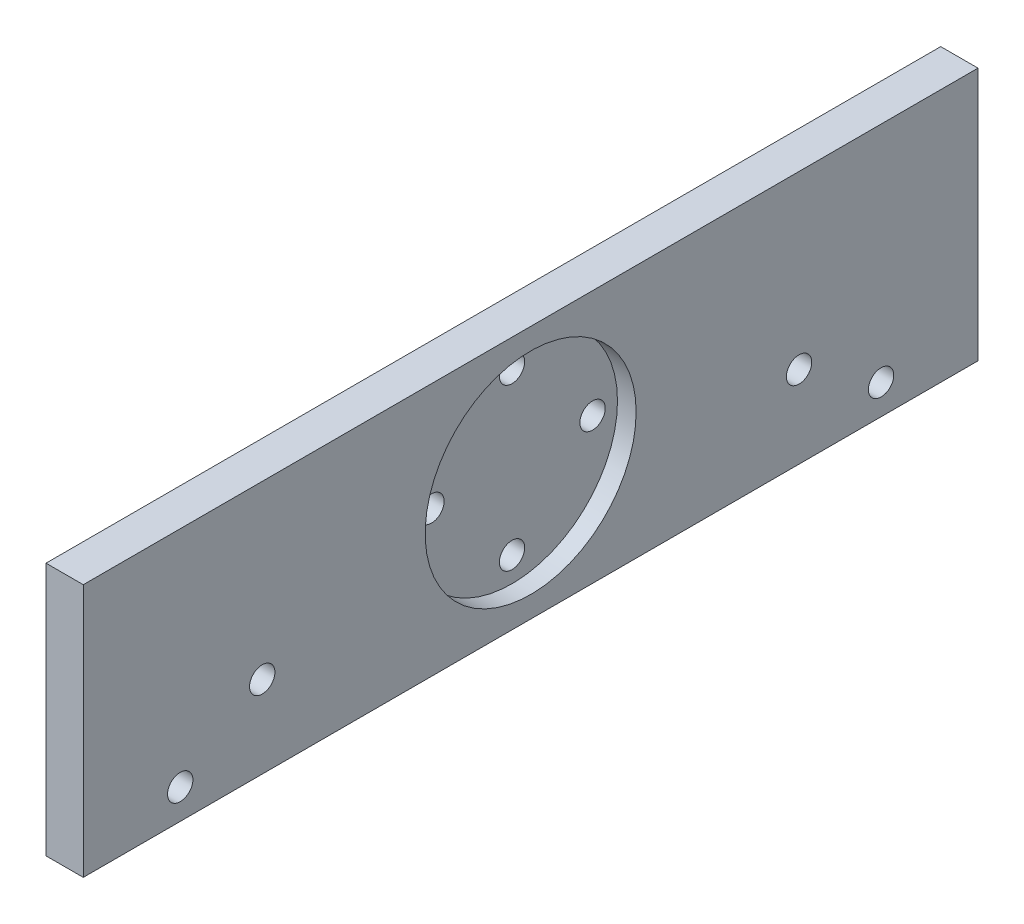
ISO-10303-21;
HEADER;
FILE_DESCRIPTION(('STEP AP214'),'2;1');
FILE_NAME('part.step','',(''),(''),'','','');
FILE_SCHEMA(('AUTOMOTIVE_DESIGN { 1 0 10303 214 1 1 1 1 }'));
ENDSEC;
DATA;
#1=APPLICATION_CONTEXT('core data for automotive mechanical design processes');
#2=APPLICATION_PROTOCOL_DEFINITION('international standard','automotive_design',2000,#1);
#3=PRODUCT_CONTEXT('',#1,'mechanical');
#4=PRODUCT('Part','Part','',(#3));
#5=PRODUCT_RELATED_PRODUCT_CATEGORY('part','',(#4));
#6=PRODUCT_DEFINITION_FORMATION('','',#4);
#7=PRODUCT_DEFINITION_CONTEXT('part definition',#1,'design');
#8=PRODUCT_DEFINITION('design','',#6,#7);
#9=PRODUCT_DEFINITION_SHAPE('','',#8);
#10=(LENGTH_UNIT() NAMED_UNIT(*) SI_UNIT(.MILLI.,.METRE.));
#11=(NAMED_UNIT(*) PLANE_ANGLE_UNIT() SI_UNIT($,.RADIAN.));
#12=(NAMED_UNIT(*) SI_UNIT($,.STERADIAN.) SOLID_ANGLE_UNIT());
#13=UNCERTAINTY_MEASURE_WITH_UNIT(LENGTH_MEASURE(1.E-05),#10,'distance_accuracy_value','');
#14=(GEOMETRIC_REPRESENTATION_CONTEXT(3) GLOBAL_UNCERTAINTY_ASSIGNED_CONTEXT((#13)) GLOBAL_UNIT_ASSIGNED_CONTEXT((#10,
#11,#12)) REPRESENTATION_CONTEXT('',''));
#15=CARTESIAN_POINT('',(0.,0.,0.));
#16=DIRECTION('',(0.,0.,1.));
#17=DIRECTION('',(1.,0.,0.));
#18=AXIS2_PLACEMENT_3D('',#15,#16,#17);
#19=CARTESIAN_POINT('',(5.,0.,120.));
#20=DIRECTION('',(0.,0.,1.));
#21=DIRECTION('',(1.,0.,0.));
#22=AXIS2_PLACEMENT_3D('',#19,#20,#21);
#23=PLANE('',#22);
#24=DIRECTION('',(0.,1.,0.));
#25=VECTOR('',#24,1.);
#26=CARTESIAN_POINT('',(0.,0.,120.));
#27=LINE('',#26,#25);
#28=CARTESIAN_POINT('',(0.,0.,120.));
#29=VERTEX_POINT('',#28);
#30=CARTESIAN_POINT('',(0.,34.,120.));
#31=VERTEX_POINT('',#30);
#32=EDGE_CURVE('E104',#29,#31,#27,.T.);
#33=ORIENTED_EDGE('',*,*,#32,.F.);
#34=DIRECTION('',(-1.,0.,0.));
#35=VECTOR('',#34,1.);
#36=CARTESIAN_POINT('',(5.,0.,120.));
#37=LINE('',#36,#35);
#38=CARTESIAN_POINT('',(5.,0.,120.));
#39=VERTEX_POINT('',#38);
#40=EDGE_CURVE('E11',#39,#29,#37,.T.);
#41=ORIENTED_EDGE('',*,*,#40,.F.);
#42=DIRECTION('',(0.,1.,0.));
#43=VECTOR('',#42,1.);
#44=CARTESIAN_POINT('',(5.,0.,120.));
#45=LINE('',#44,#43);
#46=CARTESIAN_POINT('',(5.,34.,120.));
#47=VERTEX_POINT('',#46);
#48=EDGE_CURVE('E97',#39,#47,#45,.T.);
#49=ORIENTED_EDGE('',*,*,#48,.T.);
#50=DIRECTION('',(-1.,0.,0.));
#51=VECTOR('',#50,1.);
#52=CARTESIAN_POINT('',(5.,34.,120.));
#53=LINE('',#52,#51);
#54=EDGE_CURVE('E77',#47,#31,#53,.T.);
#55=ORIENTED_EDGE('',*,*,#54,.T.);
#56=EDGE_LOOP('',(#33,#41,#49,#55));
#57=FACE_BOUND('',#56,.T.);
#58=ADVANCED_FACE('F37',(#57),#23,.T.);
#59=CARTESIAN_POINT('',(5.,0.,0.));
#60=DIRECTION('',(0.,-1.,0.));
#61=DIRECTION('',(0.,0.,-1.));
#62=AXIS2_PLACEMENT_3D('',#59,#60,#61);
#63=PLANE('',#62);
#64=DIRECTION('',(0.,0.,1.));
#65=VECTOR('',#64,1.);
#66=CARTESIAN_POINT('',(0.,0.,0.));
#67=LINE('',#66,#65);
#68=CARTESIAN_POINT('',(0.,0.,0.));
#69=VERTEX_POINT('',#68);
#70=EDGE_CURVE('E90',#69,#29,#67,.T.);
#71=ORIENTED_EDGE('',*,*,#70,.F.);
#72=DIRECTION('',(-1.,0.,0.));
#73=VECTOR('',#72,1.);
#74=CARTESIAN_POINT('',(5.,0.,0.));
#75=LINE('',#74,#73);
#76=CARTESIAN_POINT('',(5.,0.,0.));
#77=VERTEX_POINT('',#76);
#78=EDGE_CURVE('E46',#77,#69,#75,.T.);
#79=ORIENTED_EDGE('',*,*,#78,.F.);
#80=DIRECTION('',(0.,0.,1.));
#81=VECTOR('',#80,1.);
#82=CARTESIAN_POINT('',(5.,0.,0.));
#83=LINE('',#82,#81);
#84=EDGE_CURVE('E88',#77,#39,#83,.T.);
#85=ORIENTED_EDGE('',*,*,#84,.T.);
#86=ORIENTED_EDGE('',*,*,#40,.T.);
#87=EDGE_LOOP('',(#71,#79,#85,#86));
#88=FACE_BOUND('',#87,.T.);
#89=ADVANCED_FACE('F86',(#88),#63,.T.);
#90=CARTESIAN_POINT('',(5.,0.,0.));
#91=DIRECTION('',(0.,0.,1.));
#92=DIRECTION('',(0.,-1.,0.));
#93=AXIS2_PLACEMENT_3D('',#90,#91,#92);
#94=PLANE('',#93);
#95=DIRECTION('',(0.,1.,0.));
#96=VECTOR('',#95,1.);
#97=CARTESIAN_POINT('',(0.,0.,0.));
#98=LINE('',#97,#96);
#99=CARTESIAN_POINT('',(0.,34.,0.));
#100=VERTEX_POINT('',#99);
#101=EDGE_CURVE('E70',#69,#100,#98,.T.);
#102=ORIENTED_EDGE('',*,*,#101,.T.);
#103=DIRECTION('',(-1.,0.,0.));
#104=VECTOR('',#103,1.);
#105=CARTESIAN_POINT('',(5.,34.,0.));
#106=LINE('',#105,#104);
#107=CARTESIAN_POINT('',(5.,34.,0.));
#108=VERTEX_POINT('',#107);
#109=EDGE_CURVE('E91',#108,#100,#106,.T.);
#110=ORIENTED_EDGE('',*,*,#109,.F.);
#111=DIRECTION('',(0.,1.,0.));
#112=VECTOR('',#111,1.);
#113=CARTESIAN_POINT('',(5.,0.,0.));
#114=LINE('',#113,#112);
#115=EDGE_CURVE('E93',#77,#108,#114,.T.);
#116=ORIENTED_EDGE('',*,*,#115,.F.);
#117=ORIENTED_EDGE('',*,*,#78,.T.);
#118=EDGE_LOOP('',(#102,#110,#116,#117));
#119=FACE_BOUND('',#118,.T.);
#120=ADVANCED_FACE('F94',(#119),#94,.F.);
#121=CARTESIAN_POINT('',(5.,34.,0.));
#122=DIRECTION('',(0.,-1.,0.));
#123=DIRECTION('',(0.,0.,-1.));
#124=AXIS2_PLACEMENT_3D('',#121,#122,#123);
#125=PLANE('',#124);
#126=DIRECTION('',(0.,0.,1.));
#127=VECTOR('',#126,1.);
#128=CARTESIAN_POINT('',(0.,34.,0.));
#129=LINE('',#128,#127);
#130=EDGE_CURVE('E99',#100,#31,#129,.T.);
#131=ORIENTED_EDGE('',*,*,#130,.T.);
#132=ORIENTED_EDGE('',*,*,#54,.F.);
#133=DIRECTION('',(0.,0.,1.));
#134=VECTOR('',#133,1.);
#135=CARTESIAN_POINT('',(5.,34.,0.));
#136=LINE('',#135,#134);
#137=EDGE_CURVE('E55',#108,#47,#136,.T.);
#138=ORIENTED_EDGE('',*,*,#137,.F.);
#139=ORIENTED_EDGE('',*,*,#109,.T.);
#140=EDGE_LOOP('',(#131,#132,#138,#139));
#141=FACE_BOUND('',#140,.T.);
#142=ADVANCED_FACE('F147',(#141),#125,.F.);
#143=CARTESIAN_POINT('',(5.,0.,0.));
#144=DIRECTION('',(1.,0.,0.));
#145=DIRECTION('',(0.,0.,-1.));
#146=AXIS2_PLACEMENT_3D('',#143,#144,#145);
#147=PLANE('',#146);
#148=CARTESIAN_POINT('',(5.,11.,24.));
#149=DIRECTION('',(1.,0.,0.));
#150=DIRECTION('',(0.,0.,-1.));
#151=AXIS2_PLACEMENT_3D('',#148,#149,#150);
#152=CIRCLE('',#151,1.69999999999999);
#153=CARTESIAN_POINT('',(5.,11.,22.3));
#154=VERTEX_POINT('',#153);
#155=EDGE_CURVE('E293',#154,#154,#152,.T.);
#156=ORIENTED_EDGE('',*,*,#155,.F.);
#157=EDGE_LOOP('',(#156));
#158=FACE_BOUND('',#157,.T.);
#159=CARTESIAN_POINT('',(5.,4.00000000000003,13.));
#160=DIRECTION('',(1.,0.,0.));
#161=DIRECTION('',(0.,0.,-1.));
#162=AXIS2_PLACEMENT_3D('',#159,#160,#161);
#163=CIRCLE('',#162,1.69999999999999);
#164=CARTESIAN_POINT('',(5.,4.00000000000003,11.3));
#165=VERTEX_POINT('',#164);
#166=EDGE_CURVE('E303',#165,#165,#163,.T.);
#167=ORIENTED_EDGE('',*,*,#166,.F.);
#168=EDGE_LOOP('',(#167));
#169=FACE_BOUND('',#168,.T.);
#170=CARTESIAN_POINT('',(5.,11.,96.));
#171=DIRECTION('',(1.,0.,0.));
#172=DIRECTION('',(0.,0.,-1.));
#173=AXIS2_PLACEMENT_3D('',#170,#171,#172);
#174=CIRCLE('',#173,1.69999999999999);
#175=CARTESIAN_POINT('',(5.,11.,94.3));
#176=VERTEX_POINT('',#175);
#177=EDGE_CURVE('E309',#176,#176,#174,.T.);
#178=ORIENTED_EDGE('',*,*,#177,.F.);
#179=EDGE_LOOP('',(#178));
#180=FACE_BOUND('',#179,.T.);
#181=CARTESIAN_POINT('',(5.,4.00000000000001,107.));
#182=DIRECTION('',(1.,0.,0.));
#183=DIRECTION('',(0.,0.,-1.));
#184=AXIS2_PLACEMENT_3D('',#181,#182,#183);
#185=CIRCLE('',#184,1.69999999999999);
#186=CARTESIAN_POINT('',(5.,4.00000000000001,105.3));
#187=VERTEX_POINT('',#186);
#188=EDGE_CURVE('E314',#187,#187,#185,.T.);
#189=ORIENTED_EDGE('',*,*,#188,.F.);
#190=EDGE_LOOP('',(#189));
#191=FACE_BOUND('',#190,.T.);
#192=CARTESIAN_POINT('',(5.,17.,60.));
#193=DIRECTION('',(1.,0.,0.));
#194=DIRECTION('',(0.,0.,-1.));
#195=AXIS2_PLACEMENT_3D('',#192,#193,#194);
#196=CIRCLE('',#195,14.15);
#197=CARTESIAN_POINT('',(5.,17.,45.85));
#198=VERTEX_POINT('',#197);
#199=EDGE_CURVE('E138',#198,#198,#196,.T.);
#200=ORIENTED_EDGE('',*,*,#199,.F.);
#201=EDGE_LOOP('',(#200));
#202=FACE_BOUND('',#201,.T.);
#203=ORIENTED_EDGE('',*,*,#48,.F.);
#204=ORIENTED_EDGE('',*,*,#84,.F.);
#205=ORIENTED_EDGE('',*,*,#115,.T.);
#206=ORIENTED_EDGE('',*,*,#137,.T.);
#207=EDGE_LOOP('',(#203,#204,#205,#206));
#208=FACE_BOUND('',#207,.T.);
#209=ADVANCED_FACE('F96',(#158,#169,#180,#191,#202,#208),#147,.T.);
#210=CARTESIAN_POINT('',(0.,0.,0.));
#211=DIRECTION('',(1.,0.,0.));
#212=DIRECTION('',(0.,0.,-1.));
#213=AXIS2_PLACEMENT_3D('',#210,#211,#212);
#214=PLANE('',#213);
#215=CARTESIAN_POINT('',(0.,11.,24.));
#216=DIRECTION('',(-1.,0.,0.));
#217=DIRECTION('',(0.,0.,1.));
#218=AXIS2_PLACEMENT_3D('',#215,#216,#217);
#219=CIRCLE('',#218,1.69999999999999);
#220=CARTESIAN_POINT('',(0.,11.,25.7));
#221=VERTEX_POINT('',#220);
#222=EDGE_CURVE('E296',#221,#221,#219,.T.);
#223=ORIENTED_EDGE('',*,*,#222,.F.);
#224=EDGE_LOOP('',(#223));
#225=FACE_BOUND('',#224,.T.);
#226=CARTESIAN_POINT('',(0.,4.00000000000003,13.));
#227=DIRECTION('',(-1.,0.,0.));
#228=DIRECTION('',(0.,0.,1.));
#229=AXIS2_PLACEMENT_3D('',#226,#227,#228);
#230=CIRCLE('',#229,1.69999999999999);
#231=CARTESIAN_POINT('',(0.,4.00000000000003,14.7));
#232=VERTEX_POINT('',#231);
#233=EDGE_CURVE('E298',#232,#232,#230,.T.);
#234=ORIENTED_EDGE('',*,*,#233,.F.);
#235=EDGE_LOOP('',(#234));
#236=FACE_BOUND('',#235,.T.);
#237=CARTESIAN_POINT('',(0.,11.,96.));
#238=DIRECTION('',(-1.,0.,0.));
#239=DIRECTION('',(0.,0.,1.));
#240=AXIS2_PLACEMENT_3D('',#237,#238,#239);
#241=CIRCLE('',#240,1.69999999999999);
#242=CARTESIAN_POINT('',(0.,11.,97.7));
#243=VERTEX_POINT('',#242);
#244=EDGE_CURVE('E306',#243,#243,#241,.T.);
#245=ORIENTED_EDGE('',*,*,#244,.F.);
#246=EDGE_LOOP('',(#245));
#247=FACE_BOUND('',#246,.T.);
#248=CARTESIAN_POINT('',(0.,4.00000000000001,107.));
#249=DIRECTION('',(-1.,0.,0.));
#250=DIRECTION('',(0.,0.,1.));
#251=AXIS2_PLACEMENT_3D('',#248,#249,#250);
#252=CIRCLE('',#251,1.69999999999999);
#253=CARTESIAN_POINT('',(0.,4.00000000000001,108.7));
#254=VERTEX_POINT('',#253);
#255=EDGE_CURVE('E312',#254,#254,#252,.T.);
#256=ORIENTED_EDGE('',*,*,#255,.F.);
#257=EDGE_LOOP('',(#256));
#258=FACE_BOUND('',#257,.T.);
#259=CARTESIAN_POINT('',(0.,27.8,60.));
#260=DIRECTION('',(1.,0.,0.));
#261=DIRECTION('',(0.,0.,-1.));
#262=AXIS2_PLACEMENT_3D('',#259,#260,#261);
#263=CIRCLE('',#262,1.69999999999999);
#264=CARTESIAN_POINT('',(0.,27.8,58.3));
#265=VERTEX_POINT('',#264);
#266=EDGE_CURVE('E40',#265,#265,#263,.T.);
#267=ORIENTED_EDGE('',*,*,#266,.T.);
#268=EDGE_LOOP('',(#267));
#269=FACE_BOUND('',#268,.T.);
#270=CARTESIAN_POINT('',(0.,17.,49.2));
#271=DIRECTION('',(1.,0.,0.));
#272=DIRECTION('',(0.,0.,-1.));
#273=AXIS2_PLACEMENT_3D('',#270,#271,#272);
#274=CIRCLE('',#273,1.69999999999999);
#275=CARTESIAN_POINT('',(0.,17.,47.5));
#276=VERTEX_POINT('',#275);
#277=EDGE_CURVE('E117',#276,#276,#274,.T.);
#278=ORIENTED_EDGE('',*,*,#277,.T.);
#279=EDGE_LOOP('',(#278));
#280=FACE_BOUND('',#279,.T.);
#281=CARTESIAN_POINT('',(0.,6.2,60.));
#282=DIRECTION('',(1.,0.,0.));
#283=DIRECTION('',(0.,0.,-1.));
#284=AXIS2_PLACEMENT_3D('',#281,#282,#283);
#285=CIRCLE('',#284,1.69999999999999);
#286=CARTESIAN_POINT('',(0.,6.2,58.3));
#287=VERTEX_POINT('',#286);
#288=EDGE_CURVE('E113',#287,#287,#285,.T.);
#289=ORIENTED_EDGE('',*,*,#288,.T.);
#290=EDGE_LOOP('',(#289));
#291=FACE_BOUND('',#290,.T.);
#292=CARTESIAN_POINT('',(0.,17.,70.8));
#293=DIRECTION('',(1.,0.,0.));
#294=DIRECTION('',(0.,0.,-1.));
#295=AXIS2_PLACEMENT_3D('',#292,#293,#294);
#296=CIRCLE('',#295,1.69999999999999);
#297=CARTESIAN_POINT('',(0.,17.,69.1));
#298=VERTEX_POINT('',#297);
#299=EDGE_CURVE('E135',#298,#298,#296,.T.);
#300=ORIENTED_EDGE('',*,*,#299,.T.);
#301=EDGE_LOOP('',(#300));
#302=FACE_BOUND('',#301,.T.);
#303=ORIENTED_EDGE('',*,*,#32,.T.);
#304=ORIENTED_EDGE('',*,*,#130,.F.);
#305=ORIENTED_EDGE('',*,*,#101,.F.);
#306=ORIENTED_EDGE('',*,*,#70,.T.);
#307=EDGE_LOOP('',(#303,#304,#305,#306));
#308=FACE_BOUND('',#307,.T.);
#309=ADVANCED_FACE('F146',(#225,#236,#247,#258,#269,#280,#291,#302,#308),#214,.F.);
#310=CARTESIAN_POINT('',(2.5,17.,60.));
#311=DIRECTION('',(1.,0.,0.));
#312=DIRECTION('',(0.,0.,-1.));
#313=AXIS2_PLACEMENT_3D('',#310,#311,#312);
#314=CYLINDRICAL_SURFACE('',#313,14.15);
#315=CARTESIAN_POINT('',(2.5,17.,60.));
#316=DIRECTION('',(1.,0.,0.));
#317=DIRECTION('',(0.,0.,-1.));
#318=AXIS2_PLACEMENT_3D('',#315,#316,#317);
#319=CIRCLE('',#318,14.15);
#320=CARTESIAN_POINT('',(2.5,17.,45.85));
#321=VERTEX_POINT('',#320);
#322=EDGE_CURVE('E107',#321,#321,#319,.T.);
#323=ORIENTED_EDGE('',*,*,#322,.F.);
#324=EDGE_LOOP('',(#323));
#325=FACE_BOUND('',#324,.T.);
#326=ORIENTED_EDGE('',*,*,#199,.T.);
#327=EDGE_LOOP('',(#326));
#328=FACE_BOUND('',#327,.T.);
#329=ADVANCED_FACE('F143',(#325,#328),#314,.F.);
#330=CARTESIAN_POINT('',(2.5,0.,0.));
#331=DIRECTION('',(1.,0.,0.));
#332=DIRECTION('',(0.,0.,-1.));
#333=AXIS2_PLACEMENT_3D('',#330,#331,#332);
#334=PLANE('',#333);
#335=CARTESIAN_POINT('',(2.5,27.8,60.));
#336=DIRECTION('',(1.,0.,0.));
#337=DIRECTION('',(0.,0.,-1.));
#338=AXIS2_PLACEMENT_3D('',#335,#336,#337);
#339=CIRCLE('',#338,1.69999999999999);
#340=CARTESIAN_POINT('',(2.5,27.8,58.3));
#341=VERTEX_POINT('',#340);
#342=EDGE_CURVE('E129',#341,#341,#339,.T.);
#343=ORIENTED_EDGE('',*,*,#342,.F.);
#344=EDGE_LOOP('',(#343));
#345=FACE_BOUND('',#344,.T.);
#346=CARTESIAN_POINT('',(2.5,17.,49.2));
#347=DIRECTION('',(1.,0.,0.));
#348=DIRECTION('',(0.,0.,-1.));
#349=AXIS2_PLACEMENT_3D('',#346,#347,#348);
#350=CIRCLE('',#349,1.69999999999999);
#351=CARTESIAN_POINT('',(2.5,17.,47.5));
#352=VERTEX_POINT('',#351);
#353=EDGE_CURVE('E119',#352,#352,#350,.T.);
#354=ORIENTED_EDGE('',*,*,#353,.F.);
#355=EDGE_LOOP('',(#354));
#356=FACE_BOUND('',#355,.T.);
#357=CARTESIAN_POINT('',(2.5,6.2,60.));
#358=DIRECTION('',(1.,0.,0.));
#359=DIRECTION('',(0.,0.,-1.));
#360=AXIS2_PLACEMENT_3D('',#357,#358,#359);
#361=CIRCLE('',#360,1.69999999999999);
#362=CARTESIAN_POINT('',(2.5,6.2,58.3));
#363=VERTEX_POINT('',#362);
#364=EDGE_CURVE('E116',#363,#363,#361,.T.);
#365=ORIENTED_EDGE('',*,*,#364,.F.);
#366=EDGE_LOOP('',(#365));
#367=FACE_BOUND('',#366,.T.);
#368=CARTESIAN_POINT('',(2.5,17.,70.8));
#369=DIRECTION('',(1.,0.,0.));
#370=DIRECTION('',(0.,0.,-1.));
#371=AXIS2_PLACEMENT_3D('',#368,#369,#370);
#372=CIRCLE('',#371,1.69999999999999);
#373=CARTESIAN_POINT('',(2.5,17.,69.1));
#374=VERTEX_POINT('',#373);
#375=EDGE_CURVE('E115',#374,#374,#372,.T.);
#376=ORIENTED_EDGE('',*,*,#375,.F.);
#377=EDGE_LOOP('',(#376));
#378=FACE_BOUND('',#377,.T.);
#379=ORIENTED_EDGE('',*,*,#322,.T.);
#380=EDGE_LOOP('',(#379));
#381=FACE_BOUND('',#380,.T.);
#382=ADVANCED_FACE('F187',(#345,#356,#367,#378,#381),#334,.T.);
#383=CARTESIAN_POINT('',(2.5,17.,70.8));
#384=DIRECTION('',(1.,0.,0.));
#385=DIRECTION('',(0.,0.,-1.));
#386=AXIS2_PLACEMENT_3D('',#383,#384,#385);
#387=CYLINDRICAL_SURFACE('',#386,1.69999999999999);
#388=ORIENTED_EDGE('',*,*,#375,.T.);
#389=EDGE_LOOP('',(#388));
#390=FACE_BOUND('',#389,.T.);
#391=ORIENTED_EDGE('',*,*,#299,.F.);
#392=EDGE_LOOP('',(#391));
#393=FACE_BOUND('',#392,.T.);
#394=ADVANCED_FACE('F198',(#390,#393),#387,.F.);
#395=CARTESIAN_POINT('',(2.5,6.2,60.));
#396=DIRECTION('',(1.,0.,0.));
#397=DIRECTION('',(0.,0.,-1.));
#398=AXIS2_PLACEMENT_3D('',#395,#396,#397);
#399=CYLINDRICAL_SURFACE('',#398,1.69999999999999);
#400=ORIENTED_EDGE('',*,*,#364,.T.);
#401=EDGE_LOOP('',(#400));
#402=FACE_BOUND('',#401,.T.);
#403=ORIENTED_EDGE('',*,*,#288,.F.);
#404=EDGE_LOOP('',(#403));
#405=FACE_BOUND('',#404,.T.);
#406=ADVANCED_FACE('F208',(#402,#405),#399,.F.);
#407=CARTESIAN_POINT('',(2.5,17.,49.2));
#408=DIRECTION('',(1.,0.,0.));
#409=DIRECTION('',(0.,0.,-1.));
#410=AXIS2_PLACEMENT_3D('',#407,#408,#409);
#411=CYLINDRICAL_SURFACE('',#410,1.69999999999999);
#412=ORIENTED_EDGE('',*,*,#353,.T.);
#413=EDGE_LOOP('',(#412));
#414=FACE_BOUND('',#413,.T.);
#415=ORIENTED_EDGE('',*,*,#277,.F.);
#416=EDGE_LOOP('',(#415));
#417=FACE_BOUND('',#416,.T.);
#418=ADVANCED_FACE('F218',(#414,#417),#411,.F.);
#419=CARTESIAN_POINT('',(2.5,27.8,60.));
#420=DIRECTION('',(1.,0.,0.));
#421=DIRECTION('',(0.,0.,-1.));
#422=AXIS2_PLACEMENT_3D('',#419,#420,#421);
#423=CYLINDRICAL_SURFACE('',#422,1.69999999999999);
#424=ORIENTED_EDGE('',*,*,#342,.T.);
#425=EDGE_LOOP('',(#424));
#426=FACE_BOUND('',#425,.T.);
#427=ORIENTED_EDGE('',*,*,#266,.F.);
#428=EDGE_LOOP('',(#427));
#429=FACE_BOUND('',#428,.T.);
#430=ADVANCED_FACE('F228',(#426,#429),#423,.F.);
#431=CARTESIAN_POINT('',(0.,4.00000000000001,107.));
#432=DIRECTION('',(-1.,0.,0.));
#433=DIRECTION('',(0.,0.,1.));
#434=AXIS2_PLACEMENT_3D('',#431,#432,#433);
#435=CYLINDRICAL_SURFACE('',#434,1.69999999999999);
#436=ORIENTED_EDGE('',*,*,#188,.T.);
#437=EDGE_LOOP('',(#436));
#438=FACE_BOUND('',#437,.T.);
#439=ORIENTED_EDGE('',*,*,#255,.T.);
#440=EDGE_LOOP('',(#439));
#441=FACE_BOUND('',#440,.T.);
#442=ADVANCED_FACE('F236',(#438,#441),#435,.F.);
#443=CARTESIAN_POINT('',(0.,11.,96.));
#444=DIRECTION('',(-1.,0.,0.));
#445=DIRECTION('',(0.,0.,1.));
#446=AXIS2_PLACEMENT_3D('',#443,#444,#445);
#447=CYLINDRICAL_SURFACE('',#446,1.69999999999999);
#448=ORIENTED_EDGE('',*,*,#177,.T.);
#449=EDGE_LOOP('',(#448));
#450=FACE_BOUND('',#449,.T.);
#451=ORIENTED_EDGE('',*,*,#244,.T.);
#452=EDGE_LOOP('',(#451));
#453=FACE_BOUND('',#452,.T.);
#454=ADVANCED_FACE('F257',(#450,#453),#447,.F.);
#455=CARTESIAN_POINT('',(0.,4.00000000000003,13.));
#456=DIRECTION('',(-1.,0.,0.));
#457=DIRECTION('',(0.,0.,1.));
#458=AXIS2_PLACEMENT_3D('',#455,#456,#457);
#459=CYLINDRICAL_SURFACE('',#458,1.69999999999999);
#460=ORIENTED_EDGE('',*,*,#166,.T.);
#461=EDGE_LOOP('',(#460));
#462=FACE_BOUND('',#461,.T.);
#463=ORIENTED_EDGE('',*,*,#233,.T.);
#464=EDGE_LOOP('',(#463));
#465=FACE_BOUND('',#464,.T.);
#466=ADVANCED_FACE('F267',(#462,#465),#459,.F.);
#467=CARTESIAN_POINT('',(0.,11.,24.));
#468=DIRECTION('',(-1.,0.,0.));
#469=DIRECTION('',(0.,0.,1.));
#470=AXIS2_PLACEMENT_3D('',#467,#468,#469);
#471=CYLINDRICAL_SURFACE('',#470,1.69999999999999);
#472=ORIENTED_EDGE('',*,*,#155,.T.);
#473=EDGE_LOOP('',(#472));
#474=FACE_BOUND('',#473,.T.);
#475=ORIENTED_EDGE('',*,*,#222,.T.);
#476=EDGE_LOOP('',(#475));
#477=FACE_BOUND('',#476,.T.);
#478=ADVANCED_FACE('F277',(#474,#477),#471,.F.);
#479=CLOSED_SHELL('',(#58,#89,#120,#142,#209,#309,#329,#382,#394,#406,#418,#430,#442,#454,#466,#478));
#480=MANIFOLD_SOLID_BREP('B2',#479);
#481=ADVANCED_BREP_SHAPE_REPRESENTATION('',(#18,#480),#14);
#482=SHAPE_DEFINITION_REPRESENTATION(#9,#481);
ENDSEC;
END-ISO-10303-21;
